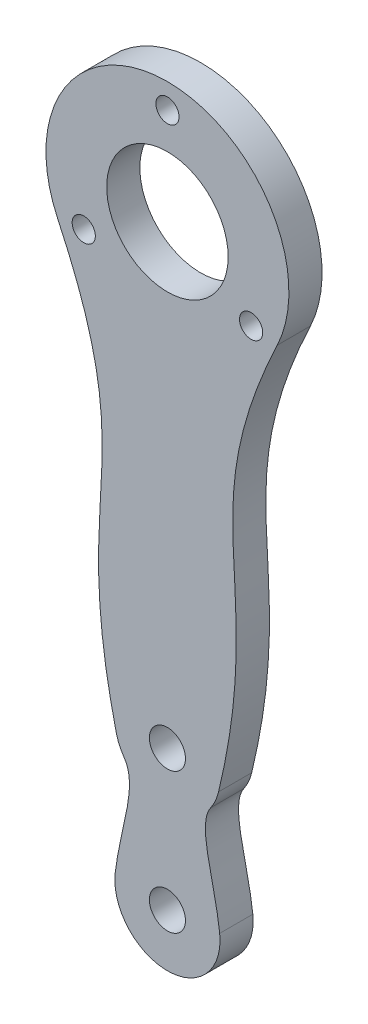
ISO-10303-21;
HEADER;
FILE_DESCRIPTION(('STEP AP214'),'2;1');
FILE_NAME('part.step','',(''),(''),'','','');
FILE_SCHEMA(('AUTOMOTIVE_DESIGN { 1 0 10303 214 1 1 1 1 }'));
ENDSEC;
DATA;
#1=APPLICATION_CONTEXT('core data for automotive mechanical design processes');
#2=APPLICATION_PROTOCOL_DEFINITION('international standard','automotive_design',2000,#1);
#3=PRODUCT_CONTEXT('',#1,'mechanical');
#4=PRODUCT('Part','Part','',(#3));
#5=PRODUCT_RELATED_PRODUCT_CATEGORY('part','',(#4));
#6=PRODUCT_DEFINITION_FORMATION('','',#4);
#7=PRODUCT_DEFINITION_CONTEXT('part definition',#1,'design');
#8=PRODUCT_DEFINITION('design','',#6,#7);
#9=PRODUCT_DEFINITION_SHAPE('','',#8);
#10=(LENGTH_UNIT() NAMED_UNIT(*) SI_UNIT(.MILLI.,.METRE.));
#11=(NAMED_UNIT(*) PLANE_ANGLE_UNIT() SI_UNIT($,.RADIAN.));
#12=(NAMED_UNIT(*) SI_UNIT($,.STERADIAN.) SOLID_ANGLE_UNIT());
#13=UNCERTAINTY_MEASURE_WITH_UNIT(LENGTH_MEASURE(1.E-05),#10,'distance_accuracy_value','');
#14=(GEOMETRIC_REPRESENTATION_CONTEXT(3) GLOBAL_UNCERTAINTY_ASSIGNED_CONTEXT((#13)) GLOBAL_UNIT_ASSIGNED_CONTEXT((#10,
#11,#12)) REPRESENTATION_CONTEXT('',''));
#15=CARTESIAN_POINT('',(0.,0.,0.));
#16=DIRECTION('',(0.,0.,1.));
#17=DIRECTION('',(1.,0.,0.));
#18=AXIS2_PLACEMENT_3D('',#15,#16,#17);
#19=CARTESIAN_POINT('',(19.8892186422392,15.9968631935293,6.));
#20=CARTESIAN_POINT('',(3.9762293286855,-17.6617903199545,6.));
#21=CARTESIAN_POINT('',(18.1477114967682,-22.2815521660645,6.));
#22=CARTESIAN_POINT('',(9.26290613826425,-59.3690526973667,6.));
#23=B_SPLINE_CURVE_WITH_KNOTS('',3,(#19,#20,#21,#22),.UNSPECIFIED.,.F.,.F.,(4,4),(0.,1.),.UNSPECIFIED.);
#24=DIRECTION('',(0.,0.,-1.));
#25=VECTOR('',#24,1.);
#26=SURFACE_OF_LINEAR_EXTRUSION('',#23,#25);
#27=CARTESIAN_POINT('',(19.8892186422392,15.9968631935293,0.));
#28=CARTESIAN_POINT('',(3.9762293286855,-17.6617903199545,0.));
#29=CARTESIAN_POINT('',(18.1477114967682,-22.2815521660645,0.));
#30=CARTESIAN_POINT('',(9.26290613826425,-59.3690526973667,0.));
#31=B_SPLINE_CURVE_WITH_KNOTS('',3,(#27,#28,#29,#30),.UNSPECIFIED.,.F.,.F.,(4,4),(0.,1.),.UNSPECIFIED.);
#32=CARTESIAN_POINT('',(19.8892186422392,15.9968631935293,0.));
#33=VERTEX_POINT('',#32);
#34=CARTESIAN_POINT('',(9.26290613826586,-59.3690526973671,0.));
#35=VERTEX_POINT('',#34);
#36=EDGE_CURVE('E217',#33,#35,#31,.T.);
#37=ORIENTED_EDGE('',*,*,#36,.F.);
#38=DIRECTION('',(0.,0.,-1.));
#39=VECTOR('',#38,1.);
#40=CARTESIAN_POINT('',(19.8892186422392,15.9968631935293,6.));
#41=LINE('',#40,#39);
#42=CARTESIAN_POINT('',(19.8892186422392,15.9968631935293,6.));
#43=VERTEX_POINT('',#42);
#44=EDGE_CURVE('E11',#43,#33,#41,.T.);
#45=ORIENTED_EDGE('',*,*,#44,.F.);
#46=CARTESIAN_POINT('',(9.26290613826586,-59.3690526973671,6.));
#47=VERTEX_POINT('',#46);
#48=EDGE_CURVE('E169',#43,#47,#23,.T.);
#49=ORIENTED_EDGE('',*,*,#48,.T.);
#50=DIRECTION('',(0.,0.,-1.));
#51=VECTOR('',#50,1.);
#52=CARTESIAN_POINT('',(9.26290613826586,-59.3690526973671,6.));
#53=LINE('',#52,#51);
#54=EDGE_CURVE('E87',#47,#35,#53,.T.);
#55=ORIENTED_EDGE('',*,*,#54,.T.);
#56=EDGE_LOOP('',(#37,#45,#49,#55));
#57=FACE_BOUND('',#56,.T.);
#58=ADVANCED_FACE('F35',(#57),#26,.T.);
#59=CARTESIAN_POINT('',(0.,25.4000000000001,6.));
#60=DIRECTION('',(0.,0.,-1.));
#61=DIRECTION('',(-1.,0.,0.));
#62=AXIS2_PLACEMENT_3D('',#59,#60,#61);
#63=CYLINDRICAL_SURFACE('',#62,22.);
#64=CARTESIAN_POINT('',(0.,25.4000000000001,0.));
#65=DIRECTION('',(0.,0.,1.));
#66=DIRECTION('',(1.,0.,0.));
#67=AXIS2_PLACEMENT_3D('',#64,#65,#66);
#68=CIRCLE('',#67,22.);
#69=CARTESIAN_POINT('',(-19.8892186422392,15.9968631935293,0.));
#70=VERTEX_POINT('',#69);
#71=EDGE_CURVE('E209',#33,#70,#68,.T.);
#72=ORIENTED_EDGE('',*,*,#71,.T.);
#73=DIRECTION('',(0.,0.,-1.));
#74=VECTOR('',#73,1.);
#75=CARTESIAN_POINT('',(-19.8892186422392,15.9968631935293,6.));
#76=LINE('',#75,#74);
#77=CARTESIAN_POINT('',(-19.8892186422392,15.9968631935293,6.));
#78=VERTEX_POINT('',#77);
#79=EDGE_CURVE('E44',#78,#70,#76,.T.);
#80=ORIENTED_EDGE('',*,*,#79,.F.);
#81=CARTESIAN_POINT('',(0.,25.4000000000001,6.));
#82=DIRECTION('',(0.,0.,1.));
#83=DIRECTION('',(1.,0.,0.));
#84=AXIS2_PLACEMENT_3D('',#81,#82,#83);
#85=CIRCLE('',#84,22.);
#86=EDGE_CURVE('E165',#43,#78,#85,.T.);
#87=ORIENTED_EDGE('',*,*,#86,.F.);
#88=ORIENTED_EDGE('',*,*,#44,.T.);
#89=EDGE_LOOP('',(#72,#80,#87,#88));
#90=FACE_BOUND('',#89,.T.);
#91=ADVANCED_FACE('F268',(#90),#63,.T.);
#92=CARTESIAN_POINT('',(-19.8892186422392,15.9968631935293,6.));
#93=CARTESIAN_POINT('',(-3.9762293286855,-17.6617903199545,6.));
#94=CARTESIAN_POINT('',(-18.1477114967682,-22.2815521660645,6.));
#95=CARTESIAN_POINT('',(-9.26290613826425,-59.3690526973667,6.));
#96=B_SPLINE_CURVE_WITH_KNOTS('',3,(#92,#93,#94,#95),.UNSPECIFIED.,.F.,.F.,(4,4),(0.,1.),.UNSPECIFIED.);
#97=DIRECTION('',(0.,0.,-1.));
#98=VECTOR('',#97,1.);
#99=SURFACE_OF_LINEAR_EXTRUSION('',#96,#98);
#100=CARTESIAN_POINT('',(-19.8892186422392,15.9968631935293,0.));
#101=CARTESIAN_POINT('',(-3.9762293286855,-17.6617903199545,0.));
#102=CARTESIAN_POINT('',(-18.1477114967682,-22.2815521660645,0.));
#103=CARTESIAN_POINT('',(-9.26290613826425,-59.3690526973667,0.));
#104=B_SPLINE_CURVE_WITH_KNOTS('',3,(#100,#101,#102,#103),.UNSPECIFIED.,.F.,.F.,(4,4),(0.,1.),.UNSPECIFIED.);
#105=CARTESIAN_POINT('',(-9.26290613826425,-59.3690526973667,0.));
#106=VERTEX_POINT('',#105);
#107=EDGE_CURVE('E201',#70,#106,#104,.T.);
#108=ORIENTED_EDGE('',*,*,#107,.T.);
#109=DIRECTION('',(0.,0.,-1.));
#110=VECTOR('',#109,1.);
#111=CARTESIAN_POINT('',(-9.26290613826425,-59.3690526973667,6.));
#112=LINE('',#111,#110);
#113=CARTESIAN_POINT('',(-9.26290613826425,-59.3690526973667,6.));
#114=VERTEX_POINT('',#113);
#115=EDGE_CURVE('E193',#114,#106,#112,.T.);
#116=ORIENTED_EDGE('',*,*,#115,.F.);
#117=EDGE_CURVE('E160',#78,#114,#96,.T.);
#118=ORIENTED_EDGE('',*,*,#117,.F.);
#119=ORIENTED_EDGE('',*,*,#79,.T.);
#120=EDGE_LOOP('',(#108,#116,#118,#119));
#121=FACE_BOUND('',#120,.T.);
#122=ADVANCED_FACE('F152',(#121),#99,.F.);
#123=CARTESIAN_POINT('',(8.48318009774885E-13,-57.1499999999999,6.));
#124=DIRECTION('',(0.,0.,-1.));
#125=DIRECTION('',(-1.,0.,0.));
#126=AXIS2_PLACEMENT_3D('',#123,#124,#125);
#127=CYLINDRICAL_SURFACE('',#126,9.525);
#128=CARTESIAN_POINT('',(8.48318009774885E-13,-57.1499999999999,0.));
#129=DIRECTION('',(0.,0.,1.));
#130=DIRECTION('',(1.,0.,0.));
#131=AXIS2_PLACEMENT_3D('',#128,#129,#130);
#132=CIRCLE('',#131,9.525);
#133=CARTESIAN_POINT('',(-7.82268723831656,-62.584260701463,0.));
#134=VERTEX_POINT('',#133);
#135=EDGE_CURVE('E212',#106,#134,#132,.T.);
#136=ORIENTED_EDGE('',*,*,#135,.T.);
#137=DIRECTION('',(0.,0.,-1.));
#138=VECTOR('',#137,1.);
#139=CARTESIAN_POINT('',(-7.82268723831656,-62.584260701463,6.));
#140=LINE('',#139,#138);
#141=CARTESIAN_POINT('',(-7.82268723831656,-62.584260701463,6.));
#142=VERTEX_POINT('',#141);
#143=EDGE_CURVE('E191',#142,#134,#140,.T.);
#144=ORIENTED_EDGE('',*,*,#143,.F.);
#145=CARTESIAN_POINT('',(8.48318009774885E-13,-57.1499999999999,6.));
#146=DIRECTION('',(0.,0.,1.));
#147=DIRECTION('',(1.,0.,0.));
#148=AXIS2_PLACEMENT_3D('',#145,#146,#147);
#149=CIRCLE('',#148,9.525);
#150=EDGE_CURVE('E128',#114,#142,#149,.T.);
#151=ORIENTED_EDGE('',*,*,#150,.F.);
#152=ORIENTED_EDGE('',*,*,#115,.T.);
#153=EDGE_LOOP('',(#136,#144,#151,#152));
#154=FACE_BOUND('',#153,.T.);
#155=ADVANCED_FACE('F150',(#154),#127,.T.);
#156=CARTESIAN_POINT('',(-9.46288727476317,-81.4640030271232,6.));
#157=CARTESIAN_POINT('',(-8.56128202282442,-73.6078219524812,6.));
#158=CARTESIAN_POINT('',(-5.27069193437997,-66.2578903252639,6.));
#159=CARTESIAN_POINT('',(-7.82268723831662,-62.5842607014631,6.));
#160=B_SPLINE_CURVE_WITH_KNOTS('',3,(#156,#157,#158,#159),.UNSPECIFIED.,.F.,.F.,(4,4),(0.,1.),.UNSPECIFIED.);
#161=DIRECTION('',(0.,0.,-1.));
#162=VECTOR('',#161,1.);
#163=SURFACE_OF_LINEAR_EXTRUSION('',#160,#162);
#164=CARTESIAN_POINT('',(-9.46288727476317,-81.4640030271232,0.));
#165=CARTESIAN_POINT('',(-8.56128202282442,-73.6078219524812,0.));
#166=CARTESIAN_POINT('',(-5.27069193437997,-66.2578903252639,0.));
#167=CARTESIAN_POINT('',(-7.82268723831662,-62.5842607014631,0.));
#168=B_SPLINE_CURVE_WITH_KNOTS('',3,(#164,#165,#166,#167),.UNSPECIFIED.,.F.,.F.,(4,4),(0.,1.),.UNSPECIFIED.);
#169=CARTESIAN_POINT('',(-9.4628872747632,-81.4640030271232,0.));
#170=VERTEX_POINT('',#169);
#171=EDGE_CURVE('E214',#170,#134,#168,.T.);
#172=ORIENTED_EDGE('',*,*,#171,.F.);
#173=DIRECTION('',(0.,0.,-1.));
#174=VECTOR('',#173,1.);
#175=CARTESIAN_POINT('',(-9.4628872747632,-81.4640030271232,6.));
#176=LINE('',#175,#174);
#177=CARTESIAN_POINT('',(-9.4628872747632,-81.4640030271232,6.));
#178=VERTEX_POINT('',#177);
#179=EDGE_CURVE('E121',#178,#170,#176,.T.);
#180=ORIENTED_EDGE('',*,*,#179,.F.);
#181=EDGE_CURVE('E114',#178,#142,#160,.T.);
#182=ORIENTED_EDGE('',*,*,#181,.T.);
#183=ORIENTED_EDGE('',*,*,#143,.T.);
#184=EDGE_LOOP('',(#172,#180,#182,#183));
#185=FACE_BOUND('',#184,.T.);
#186=ADVANCED_FACE('F147',(#185),#163,.T.);
#187=CARTESIAN_POINT('',(1.48145384848419E-12,-82.5499999999996,6.));
#188=DIRECTION('',(0.,0.,-1.));
#189=DIRECTION('',(-1.,0.,0.));
#190=AXIS2_PLACEMENT_3D('',#187,#188,#189);
#191=CYLINDRICAL_SURFACE('',#190,9.525);
#192=CARTESIAN_POINT('',(1.48145384848419E-12,-82.5499999999996,0.));
#193=DIRECTION('',(0.,0.,1.));
#194=DIRECTION('',(1.,0.,0.));
#195=AXIS2_PLACEMENT_3D('',#192,#193,#194);
#196=CIRCLE('',#195,9.525);
#197=CARTESIAN_POINT('',(9.46288727476613,-81.4640030271229,0.));
#198=VERTEX_POINT('',#197);
#199=EDGE_CURVE('E120',#170,#198,#196,.T.);
#200=ORIENTED_EDGE('',*,*,#199,.T.);
#201=DIRECTION('',(0.,0.,-1.));
#202=VECTOR('',#201,1.);
#203=CARTESIAN_POINT('',(9.46288727476613,-81.4640030271229,6.));
#204=LINE('',#203,#202);
#205=CARTESIAN_POINT('',(9.46288727476613,-81.4640030271229,6.));
#206=VERTEX_POINT('',#205);
#207=EDGE_CURVE('E117',#206,#198,#204,.T.);
#208=ORIENTED_EDGE('',*,*,#207,.F.);
#209=CARTESIAN_POINT('',(1.48145384848419E-12,-82.5499999999996,6.));
#210=DIRECTION('',(0.,0.,1.));
#211=DIRECTION('',(1.,0.,0.));
#212=AXIS2_PLACEMENT_3D('',#209,#210,#211);
#213=CIRCLE('',#212,9.525);
#214=EDGE_CURVE('E107',#178,#206,#213,.T.);
#215=ORIENTED_EDGE('',*,*,#214,.F.);
#216=ORIENTED_EDGE('',*,*,#179,.T.);
#217=EDGE_LOOP('',(#200,#208,#215,#216));
#218=FACE_BOUND('',#217,.T.);
#219=ADVANCED_FACE('F118',(#218),#191,.T.);
#220=CARTESIAN_POINT('',(9.46288727476317,-81.4640030271232,6.));
#221=CARTESIAN_POINT('',(8.56128202282442,-73.6078219524812,6.));
#222=CARTESIAN_POINT('',(5.27069193437997,-66.2578903252639,6.));
#223=CARTESIAN_POINT('',(7.82268723831662,-62.5842607014631,6.));
#224=B_SPLINE_CURVE_WITH_KNOTS('',3,(#220,#221,#222,#223),.UNSPECIFIED.,.F.,.F.,(4,4),(0.,1.),.UNSPECIFIED.);
#225=DIRECTION('',(0.,0.,-1.));
#226=VECTOR('',#225,1.);
#227=SURFACE_OF_LINEAR_EXTRUSION('',#224,#226);
#228=CARTESIAN_POINT('',(9.46288727476317,-81.4640030271232,0.));
#229=CARTESIAN_POINT('',(8.56128202282442,-73.6078219524812,0.));
#230=CARTESIAN_POINT('',(5.27069193437997,-66.2578903252639,0.));
#231=CARTESIAN_POINT('',(7.82268723831662,-62.5842607014631,0.));
#232=B_SPLINE_CURVE_WITH_KNOTS('',3,(#228,#229,#230,#231),.UNSPECIFIED.,.F.,.F.,(4,4),(0.,1.),.UNSPECIFIED.);
#233=CARTESIAN_POINT('',(7.82268723831771,-62.5842607014638,0.));
#234=VERTEX_POINT('',#233);
#235=EDGE_CURVE('E80',#198,#234,#232,.T.);
#236=ORIENTED_EDGE('',*,*,#235,.T.);
#237=DIRECTION('',(0.,0.,-1.));
#238=VECTOR('',#237,1.);
#239=CARTESIAN_POINT('',(7.82268723831771,-62.5842607014638,6.));
#240=LINE('',#239,#238);
#241=CARTESIAN_POINT('',(7.82268723831771,-62.5842607014638,6.));
#242=VERTEX_POINT('',#241);
#243=EDGE_CURVE('E122',#242,#234,#240,.T.);
#244=ORIENTED_EDGE('',*,*,#243,.F.);
#245=EDGE_CURVE('E112',#206,#242,#224,.T.);
#246=ORIENTED_EDGE('',*,*,#245,.F.);
#247=ORIENTED_EDGE('',*,*,#207,.T.);
#248=EDGE_LOOP('',(#236,#244,#246,#247));
#249=FACE_BOUND('',#248,.T.);
#250=ADVANCED_FACE('F124',(#249),#227,.F.);
#251=CARTESIAN_POINT('',(0.,42.9000000000001,6.));
#252=DIRECTION('',(0.,0.,-1.));
#253=DIRECTION('',(-1.,0.,0.));
#254=AXIS2_PLACEMENT_3D('',#251,#252,#253);
#255=CYLINDRICAL_SURFACE('',#254,2.1);
#256=CARTESIAN_POINT('',(0.,42.9000000000001,6.));
#257=DIRECTION('',(0.,0.,1.));
#258=DIRECTION('',(1.,0.,0.));
#259=AXIS2_PLACEMENT_3D('',#256,#257,#258);
#260=CIRCLE('',#259,2.1);
#261=CARTESIAN_POINT('',(2.1,42.9000000000001,6.));
#262=VERTEX_POINT('',#261);
#263=EDGE_CURVE('E281',#262,#262,#260,.T.);
#264=ORIENTED_EDGE('',*,*,#263,.T.);
#265=EDGE_LOOP('',(#264));
#266=FACE_BOUND('',#265,.T.);
#267=CARTESIAN_POINT('',(0.,42.9000000000001,0.));
#268=DIRECTION('',(0.,0.,1.));
#269=DIRECTION('',(1.,0.,0.));
#270=AXIS2_PLACEMENT_3D('',#267,#268,#269);
#271=CIRCLE('',#270,2.1);
#272=CARTESIAN_POINT('',(2.1,42.9000000000001,0.));
#273=VERTEX_POINT('',#272);
#274=EDGE_CURVE('E178',#273,#273,#271,.T.);
#275=ORIENTED_EDGE('',*,*,#274,.F.);
#276=EDGE_LOOP('',(#275));
#277=FACE_BOUND('',#276,.T.);
#278=ADVANCED_FACE('F142',(#266,#277),#255,.F.);
#279=CARTESIAN_POINT('',(15.1554445662277,16.6500000000001,6.));
#280=DIRECTION('',(0.,0.,-1.));
#281=DIRECTION('',(-1.,0.,0.));
#282=AXIS2_PLACEMENT_3D('',#279,#280,#281);
#283=CYLINDRICAL_SURFACE('',#282,2.1);
#284=CARTESIAN_POINT('',(15.1554445662277,16.6500000000001,6.));
#285=DIRECTION('',(0.,0.,1.));
#286=DIRECTION('',(1.,0.,0.));
#287=AXIS2_PLACEMENT_3D('',#284,#285,#286);
#288=CIRCLE('',#287,2.1);
#289=CARTESIAN_POINT('',(17.2554445662277,16.6500000000001,6.));
#290=VERTEX_POINT('',#289);
#291=EDGE_CURVE('E284',#290,#290,#288,.T.);
#292=ORIENTED_EDGE('',*,*,#291,.T.);
#293=EDGE_LOOP('',(#292));
#294=FACE_BOUND('',#293,.T.);
#295=CARTESIAN_POINT('',(15.1554445662277,16.6500000000001,0.));
#296=DIRECTION('',(0.,0.,1.));
#297=DIRECTION('',(1.,0.,0.));
#298=AXIS2_PLACEMENT_3D('',#295,#296,#297);
#299=CIRCLE('',#298,2.1);
#300=CARTESIAN_POINT('',(17.2554445662277,16.6500000000001,0.));
#301=VERTEX_POINT('',#300);
#302=EDGE_CURVE('E183',#301,#301,#299,.T.);
#303=ORIENTED_EDGE('',*,*,#302,.F.);
#304=EDGE_LOOP('',(#303));
#305=FACE_BOUND('',#304,.T.);
#306=ADVANCED_FACE('F252',(#294,#305),#283,.F.);
#307=CARTESIAN_POINT('',(-15.1554445662277,16.6500000000001,6.));
#308=DIRECTION('',(0.,0.,-1.));
#309=DIRECTION('',(-1.,0.,0.));
#310=AXIS2_PLACEMENT_3D('',#307,#308,#309);
#311=CYLINDRICAL_SURFACE('',#310,2.1);
#312=CARTESIAN_POINT('',(-15.1554445662277,16.6500000000001,6.));
#313=DIRECTION('',(0.,0.,1.));
#314=DIRECTION('',(1.,0.,0.));
#315=AXIS2_PLACEMENT_3D('',#312,#313,#314);
#316=CIRCLE('',#315,2.1);
#317=CARTESIAN_POINT('',(-13.0554445662277,16.6500000000001,6.));
#318=VERTEX_POINT('',#317);
#319=EDGE_CURVE('E286',#318,#318,#316,.T.);
#320=ORIENTED_EDGE('',*,*,#319,.T.);
#321=EDGE_LOOP('',(#320));
#322=FACE_BOUND('',#321,.T.);
#323=CARTESIAN_POINT('',(-15.1554445662277,16.6500000000001,0.));
#324=DIRECTION('',(0.,0.,1.));
#325=DIRECTION('',(1.,0.,0.));
#326=AXIS2_PLACEMENT_3D('',#323,#324,#325);
#327=CIRCLE('',#326,2.1);
#328=CARTESIAN_POINT('',(-13.0554445662277,16.6500000000001,0.));
#329=VERTEX_POINT('',#328);
#330=EDGE_CURVE('E245',#329,#329,#327,.T.);
#331=ORIENTED_EDGE('',*,*,#330,.F.);
#332=EDGE_LOOP('',(#331));
#333=FACE_BOUND('',#332,.T.);
#334=ADVANCED_FACE('F254',(#322,#333),#311,.F.);
#335=CARTESIAN_POINT('',(0.,25.4000000000001,6.));
#336=DIRECTION('',(0.,0.,-1.));
#337=DIRECTION('',(-1.,0.,0.));
#338=AXIS2_PLACEMENT_3D('',#335,#336,#337);
#339=CYLINDRICAL_SURFACE('',#338,11.);
#340=CARTESIAN_POINT('',(0.,25.4000000000001,6.));
#341=DIRECTION('',(0.,0.,1.));
#342=DIRECTION('',(1.,0.,0.));
#343=AXIS2_PLACEMENT_3D('',#340,#341,#342);
#344=CIRCLE('',#343,11.);
#345=CARTESIAN_POINT('',(11.,25.4000000000001,6.));
#346=VERTEX_POINT('',#345);
#347=EDGE_CURVE('E288',#346,#346,#344,.T.);
#348=ORIENTED_EDGE('',*,*,#347,.T.);
#349=EDGE_LOOP('',(#348));
#350=FACE_BOUND('',#349,.T.);
#351=CARTESIAN_POINT('',(0.,25.4000000000001,0.));
#352=DIRECTION('',(0.,0.,1.));
#353=DIRECTION('',(1.,0.,0.));
#354=AXIS2_PLACEMENT_3D('',#351,#352,#353);
#355=CIRCLE('',#354,11.);
#356=CARTESIAN_POINT('',(11.,25.4000000000001,0.));
#357=VERTEX_POINT('',#356);
#358=EDGE_CURVE('E242',#357,#357,#355,.T.);
#359=ORIENTED_EDGE('',*,*,#358,.F.);
#360=EDGE_LOOP('',(#359));
#361=FACE_BOUND('',#360,.T.);
#362=ADVANCED_FACE('F261',(#350,#361),#339,.F.);
#363=CARTESIAN_POINT('',(8.48318009774885E-13,-57.1499999999999,6.));
#364=DIRECTION('',(0.,0.,-1.));
#365=DIRECTION('',(-1.,0.,0.));
#366=AXIS2_PLACEMENT_3D('',#363,#364,#365);
#367=CYLINDRICAL_SURFACE('',#366,3.26390000000001);
#368=CARTESIAN_POINT('',(8.48318009774885E-13,-57.1499999999999,6.));
#369=DIRECTION('',(0.,0.,1.));
#370=DIRECTION('',(1.,0.,0.));
#371=AXIS2_PLACEMENT_3D('',#368,#369,#370);
#372=CIRCLE('',#371,3.26390000000001);
#373=CARTESIAN_POINT('',(3.26390000000085,-57.1499999999999,6.));
#374=VERTEX_POINT('',#373);
#375=EDGE_CURVE('E126',#374,#374,#372,.T.);
#376=ORIENTED_EDGE('',*,*,#375,.T.);
#377=EDGE_LOOP('',(#376));
#378=FACE_BOUND('',#377,.T.);
#379=CARTESIAN_POINT('',(8.48318009774885E-13,-57.1499999999999,0.));
#380=DIRECTION('',(0.,0.,1.));
#381=DIRECTION('',(1.,0.,0.));
#382=AXIS2_PLACEMENT_3D('',#379,#380,#381);
#383=CIRCLE('',#382,3.26390000000001);
#384=CARTESIAN_POINT('',(3.26390000000085,-57.1499999999999,0.));
#385=VERTEX_POINT('',#384);
#386=EDGE_CURVE('E236',#385,#385,#383,.T.);
#387=ORIENTED_EDGE('',*,*,#386,.F.);
#388=EDGE_LOOP('',(#387));
#389=FACE_BOUND('',#388,.T.);
#390=ADVANCED_FACE('F295',(#378,#389),#367,.F.);
#391=EDGE_CURVE('E216',#234,#35,#132,.T.);
#392=ORIENTED_EDGE('',*,*,#391,.T.);
#393=ORIENTED_EDGE('',*,*,#54,.F.);
#394=EDGE_CURVE('E52',#242,#47,#149,.T.);
#395=ORIENTED_EDGE('',*,*,#394,.F.);
#396=ORIENTED_EDGE('',*,*,#243,.T.);
#397=EDGE_LOOP('',(#392,#393,#395,#396));
#398=FACE_BOUND('',#397,.T.);
#399=ADVANCED_FACE('F143',(#398),#127,.T.);
#400=CARTESIAN_POINT('',(1.48145384848419E-12,-82.5499999999996,6.));
#401=DIRECTION('',(0.,0.,-1.));
#402=DIRECTION('',(-1.,0.,0.));
#403=AXIS2_PLACEMENT_3D('',#400,#401,#402);
#404=CYLINDRICAL_SURFACE('',#403,3.2639);
#405=CARTESIAN_POINT('',(1.48145384848419E-12,-82.5499999999996,6.));
#406=DIRECTION('',(0.,0.,1.));
#407=DIRECTION('',(1.,0.,0.));
#408=AXIS2_PLACEMENT_3D('',#405,#406,#407);
#409=CIRCLE('',#408,3.2639);
#410=CARTESIAN_POINT('',(3.26390000000148,-82.5499999999996,6.));
#411=VERTEX_POINT('',#410);
#412=EDGE_CURVE('E188',#411,#411,#409,.T.);
#413=ORIENTED_EDGE('',*,*,#412,.T.);
#414=EDGE_LOOP('',(#413));
#415=FACE_BOUND('',#414,.T.);
#416=CARTESIAN_POINT('',(1.48145384848419E-12,-82.5499999999996,0.));
#417=DIRECTION('',(0.,0.,1.));
#418=DIRECTION('',(1.,0.,0.));
#419=AXIS2_PLACEMENT_3D('',#416,#417,#418);
#420=CIRCLE('',#419,3.2639);
#421=CARTESIAN_POINT('',(3.26390000000148,-82.5499999999996,0.));
#422=VERTEX_POINT('',#421);
#423=EDGE_CURVE('E173',#422,#422,#420,.T.);
#424=ORIENTED_EDGE('',*,*,#423,.F.);
#425=EDGE_LOOP('',(#424));
#426=FACE_BOUND('',#425,.T.);
#427=ADVANCED_FACE('F299',(#415,#426),#404,.F.);
#428=CARTESIAN_POINT('',(0.,0.,6.));
#429=DIRECTION('',(0.,0.,1.));
#430=DIRECTION('',(1.,0.,0.));
#431=AXIS2_PLACEMENT_3D('',#428,#429,#430);
#432=PLANE('',#431);
#433=ORIENTED_EDGE('',*,*,#48,.F.);
#434=ORIENTED_EDGE('',*,*,#86,.T.);
#435=ORIENTED_EDGE('',*,*,#117,.T.);
#436=ORIENTED_EDGE('',*,*,#150,.T.);
#437=ORIENTED_EDGE('',*,*,#181,.F.);
#438=ORIENTED_EDGE('',*,*,#214,.T.);
#439=ORIENTED_EDGE('',*,*,#245,.T.);
#440=ORIENTED_EDGE('',*,*,#394,.T.);
#441=EDGE_LOOP('',(#433,#434,#435,#436,#437,#438,#439,#440));
#442=FACE_BOUND('',#441,.T.);
#443=ORIENTED_EDGE('',*,*,#375,.F.);
#444=EDGE_LOOP('',(#443));
#445=FACE_BOUND('',#444,.T.);
#446=ORIENTED_EDGE('',*,*,#347,.F.);
#447=EDGE_LOOP('',(#446));
#448=FACE_BOUND('',#447,.T.);
#449=ORIENTED_EDGE('',*,*,#319,.F.);
#450=EDGE_LOOP('',(#449));
#451=FACE_BOUND('',#450,.T.);
#452=ORIENTED_EDGE('',*,*,#291,.F.);
#453=EDGE_LOOP('',(#452));
#454=FACE_BOUND('',#453,.T.);
#455=ORIENTED_EDGE('',*,*,#263,.F.);
#456=EDGE_LOOP('',(#455));
#457=FACE_BOUND('',#456,.T.);
#458=ORIENTED_EDGE('',*,*,#412,.F.);
#459=EDGE_LOOP('',(#458));
#460=FACE_BOUND('',#459,.T.);
#461=ADVANCED_FACE('F109',(#442,#445,#448,#451,#454,#457,#460),#432,.T.);
#462=CARTESIAN_POINT('',(0.,0.,0.));
#463=DIRECTION('',(0.,0.,1.));
#464=DIRECTION('',(1.,0.,0.));
#465=AXIS2_PLACEMENT_3D('',#462,#463,#464);
#466=PLANE('',#465);
#467=ORIENTED_EDGE('',*,*,#36,.T.);
#468=ORIENTED_EDGE('',*,*,#391,.F.);
#469=ORIENTED_EDGE('',*,*,#235,.F.);
#470=ORIENTED_EDGE('',*,*,#199,.F.);
#471=ORIENTED_EDGE('',*,*,#171,.T.);
#472=ORIENTED_EDGE('',*,*,#135,.F.);
#473=ORIENTED_EDGE('',*,*,#107,.F.);
#474=ORIENTED_EDGE('',*,*,#71,.F.);
#475=EDGE_LOOP('',(#467,#468,#469,#470,#471,#472,#473,#474));
#476=FACE_BOUND('',#475,.T.);
#477=ORIENTED_EDGE('',*,*,#386,.T.);
#478=EDGE_LOOP('',(#477));
#479=FACE_BOUND('',#478,.T.);
#480=ORIENTED_EDGE('',*,*,#358,.T.);
#481=EDGE_LOOP('',(#480));
#482=FACE_BOUND('',#481,.T.);
#483=ORIENTED_EDGE('',*,*,#330,.T.);
#484=EDGE_LOOP('',(#483));
#485=FACE_BOUND('',#484,.T.);
#486=ORIENTED_EDGE('',*,*,#302,.T.);
#487=EDGE_LOOP('',(#486));
#488=FACE_BOUND('',#487,.T.);
#489=ORIENTED_EDGE('',*,*,#274,.T.);
#490=EDGE_LOOP('',(#489));
#491=FACE_BOUND('',#490,.T.);
#492=ORIENTED_EDGE('',*,*,#423,.T.);
#493=EDGE_LOOP('',(#492));
#494=FACE_BOUND('',#493,.T.);
#495=ADVANCED_FACE('F207',(#476,#479,#482,#485,#488,#491,#494),#466,.F.);
#496=CLOSED_SHELL('',(#58,#91,#122,#155,#186,#219,#250,#278,#306,#334,#362,#390,#399,#427,#461,#495));
#497=MANIFOLD_SOLID_BREP('B2',#496);
#498=ADVANCED_BREP_SHAPE_REPRESENTATION('',(#18,#497),#14);
#499=SHAPE_DEFINITION_REPRESENTATION(#9,#498);
ENDSEC;
END-ISO-10303-21;
